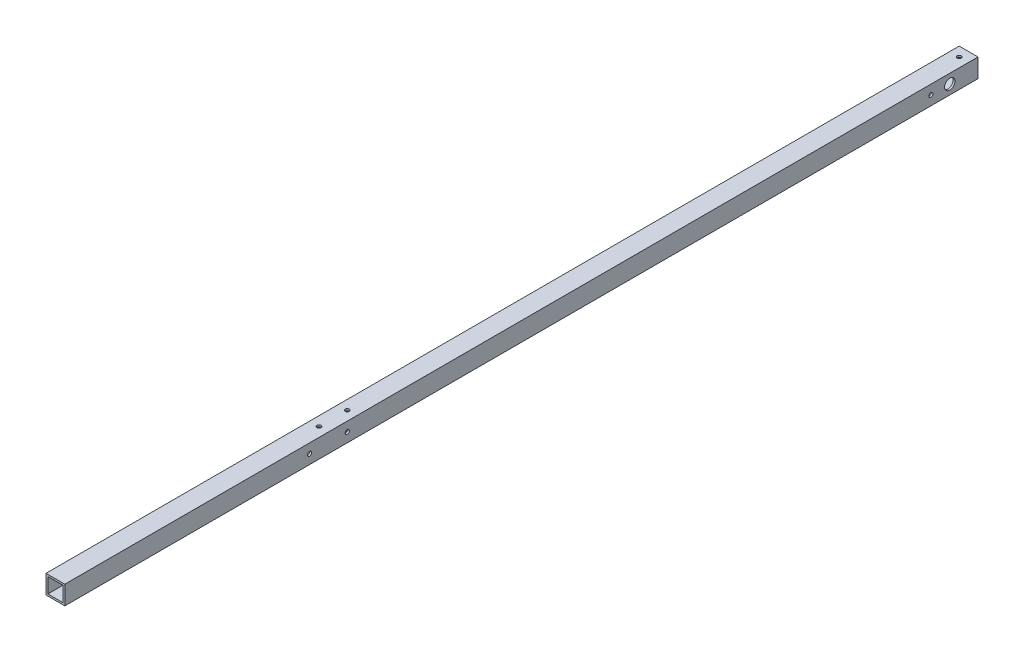
ISO-10303-21;
HEADER;
FILE_DESCRIPTION(('STEP AP214'),'2;1');
FILE_NAME('part.step','',(''),(''),'','','');
FILE_SCHEMA(('AUTOMOTIVE_DESIGN { 1 0 10303 214 1 1 1 1 }'));
ENDSEC;
DATA;
#1=APPLICATION_CONTEXT('core data for automotive mechanical design processes');
#2=APPLICATION_PROTOCOL_DEFINITION('international standard','automotive_design',2000,#1);
#3=PRODUCT_CONTEXT('',#1,'mechanical');
#4=PRODUCT('Part','Part','',(#3));
#5=PRODUCT_RELATED_PRODUCT_CATEGORY('part','',(#4));
#6=PRODUCT_DEFINITION_FORMATION('','',#4);
#7=PRODUCT_DEFINITION_CONTEXT('part definition',#1,'design');
#8=PRODUCT_DEFINITION('design','',#6,#7);
#9=PRODUCT_DEFINITION_SHAPE('','',#8);
#10=(LENGTH_UNIT() NAMED_UNIT(*) SI_UNIT(.MILLI.,.METRE.));
#11=(NAMED_UNIT(*) PLANE_ANGLE_UNIT() SI_UNIT($,.RADIAN.));
#12=(NAMED_UNIT(*) SI_UNIT($,.STERADIAN.) SOLID_ANGLE_UNIT());
#13=UNCERTAINTY_MEASURE_WITH_UNIT(LENGTH_MEASURE(1.E-05),#10,'distance_accuracy_value','');
#14=(GEOMETRIC_REPRESENTATION_CONTEXT(3) GLOBAL_UNCERTAINTY_ASSIGNED_CONTEXT((#13)) GLOBAL_UNIT_ASSIGNED_CONTEXT((#10,
#11,#12)) REPRESENTATION_CONTEXT('',''));
#15=CARTESIAN_POINT('',(0.,0.,0.));
#16=DIRECTION('',(0.,0.,1.));
#17=DIRECTION('',(1.,0.,0.));
#18=AXIS2_PLACEMENT_3D('',#15,#16,#17);
#19=CARTESIAN_POINT('',(0.,0.,970.));
#20=DIRECTION('',(0.,0.,1.));
#21=DIRECTION('',(1.,0.,0.));
#22=AXIS2_PLACEMENT_3D('',#19,#20,#21);
#23=PLANE('',#22);
#24=DIRECTION('',(0.,1.,0.));
#25=VECTOR('',#24,1.);
#26=CARTESIAN_POINT('',(10.,10.,970.));
#27=LINE('',#26,#25);
#28=CARTESIAN_POINT('',(10.,-10.,970.));
#29=VERTEX_POINT('',#28);
#30=CARTESIAN_POINT('',(10.,10.,970.));
#31=VERTEX_POINT('',#30);
#32=EDGE_CURVE('E157',#29,#31,#27,.T.);
#33=ORIENTED_EDGE('',*,*,#32,.T.);
#34=DIRECTION('',(-1.,0.,0.));
#35=VECTOR('',#34,1.);
#36=CARTESIAN_POINT('',(-10.,10.,970.));
#37=LINE('',#36,#35);
#38=CARTESIAN_POINT('',(-10.,10.,970.));
#39=VERTEX_POINT('',#38);
#40=EDGE_CURVE('E161',#31,#39,#37,.T.);
#41=ORIENTED_EDGE('',*,*,#40,.T.);
#42=DIRECTION('',(0.,-1.,0.));
#43=VECTOR('',#42,1.);
#44=CARTESIAN_POINT('',(-10.,10.,970.));
#45=LINE('',#44,#43);
#46=CARTESIAN_POINT('',(-10.,-10.,970.));
#47=VERTEX_POINT('',#46);
#48=EDGE_CURVE('E165',#39,#47,#45,.T.);
#49=ORIENTED_EDGE('',*,*,#48,.T.);
#50=DIRECTION('',(1.,0.,0.));
#51=VECTOR('',#50,1.);
#52=CARTESIAN_POINT('',(-10.,-10.,970.));
#53=LINE('',#52,#51);
#54=EDGE_CURVE('E168',#47,#29,#53,.T.);
#55=ORIENTED_EDGE('',*,*,#54,.T.);
#56=EDGE_LOOP('',(#33,#41,#49,#55));
#57=FACE_BOUND('',#56,.T.);
#58=DIRECTION('',(-1.,0.,0.));
#59=VECTOR('',#58,1.);
#60=CARTESIAN_POINT('',(-8.,8.,970.));
#61=LINE('',#60,#59);
#62=CARTESIAN_POINT('',(8.,8.,970.));
#63=VERTEX_POINT('',#62);
#64=CARTESIAN_POINT('',(-8.,8.,970.));
#65=VERTEX_POINT('',#64);
#66=EDGE_CURVE('E116',#63,#65,#61,.T.);
#67=ORIENTED_EDGE('',*,*,#66,.F.);
#68=DIRECTION('',(0.,1.,0.));
#69=VECTOR('',#68,1.);
#70=CARTESIAN_POINT('',(8.,8.,970.));
#71=LINE('',#70,#69);
#72=CARTESIAN_POINT('',(8.,-8.,970.));
#73=VERTEX_POINT('',#72);
#74=EDGE_CURVE('E107',#73,#63,#71,.T.);
#75=ORIENTED_EDGE('',*,*,#74,.F.);
#76=DIRECTION('',(1.,0.,0.));
#77=VECTOR('',#76,1.);
#78=CARTESIAN_POINT('',(-8.,-8.,970.));
#79=LINE('',#78,#77);
#80=CARTESIAN_POINT('',(-8.,-8.,970.));
#81=VERTEX_POINT('',#80);
#82=EDGE_CURVE('E133',#81,#73,#79,.T.);
#83=ORIENTED_EDGE('',*,*,#82,.F.);
#84=DIRECTION('',(0.,-1.,0.));
#85=VECTOR('',#84,1.);
#86=CARTESIAN_POINT('',(-8.,8.,970.));
#87=LINE('',#86,#85);
#88=EDGE_CURVE('E129',#65,#81,#87,.T.);
#89=ORIENTED_EDGE('',*,*,#88,.F.);
#90=EDGE_LOOP('',(#67,#75,#83,#89));
#91=FACE_BOUND('',#90,.T.);
#92=ADVANCED_FACE('F39',(#57,#91),#23,.T.);
#93=CARTESIAN_POINT('',(0.,0.,0.));
#94=DIRECTION('',(0.,0.,1.));
#95=DIRECTION('',(1.,0.,0.));
#96=AXIS2_PLACEMENT_3D('',#93,#94,#95);
#97=PLANE('',#96);
#98=DIRECTION('',(0.,1.,0.));
#99=VECTOR('',#98,1.);
#100=CARTESIAN_POINT('',(10.,10.,0.));
#101=LINE('',#100,#99);
#102=CARTESIAN_POINT('',(10.,-10.,0.));
#103=VERTEX_POINT('',#102);
#104=CARTESIAN_POINT('',(10.,10.,0.));
#105=VERTEX_POINT('',#104);
#106=EDGE_CURVE('E125',#103,#105,#101,.T.);
#107=ORIENTED_EDGE('',*,*,#106,.F.);
#108=DIRECTION('',(1.,0.,0.));
#109=VECTOR('',#108,1.);
#110=CARTESIAN_POINT('',(-10.,-10.,0.));
#111=LINE('',#110,#109);
#112=CARTESIAN_POINT('',(-10.,-10.,0.));
#113=VERTEX_POINT('',#112);
#114=EDGE_CURVE('E162',#113,#103,#111,.T.);
#115=ORIENTED_EDGE('',*,*,#114,.F.);
#116=DIRECTION('',(0.,-1.,0.));
#117=VECTOR('',#116,1.);
#118=CARTESIAN_POINT('',(-10.,10.,0.));
#119=LINE('',#118,#117);
#120=CARTESIAN_POINT('',(-10.,10.,0.));
#121=VERTEX_POINT('',#120);
#122=EDGE_CURVE('E178',#121,#113,#119,.T.);
#123=ORIENTED_EDGE('',*,*,#122,.F.);
#124=DIRECTION('',(-1.,0.,0.));
#125=VECTOR('',#124,1.);
#126=CARTESIAN_POINT('',(-10.,10.,0.));
#127=LINE('',#126,#125);
#128=EDGE_CURVE('E175',#105,#121,#127,.T.);
#129=ORIENTED_EDGE('',*,*,#128,.F.);
#130=EDGE_LOOP('',(#107,#115,#123,#129));
#131=FACE_BOUND('',#130,.T.);
#132=DIRECTION('',(0.,1.,0.));
#133=VECTOR('',#132,1.);
#134=CARTESIAN_POINT('',(8.,8.,0.));
#135=LINE('',#134,#133);
#136=CARTESIAN_POINT('',(8.,-8.,0.));
#137=VERTEX_POINT('',#136);
#138=CARTESIAN_POINT('',(8.,8.,0.));
#139=VERTEX_POINT('',#138);
#140=EDGE_CURVE('E65',#137,#139,#135,.T.);
#141=ORIENTED_EDGE('',*,*,#140,.T.);
#142=DIRECTION('',(-1.,0.,0.));
#143=VECTOR('',#142,1.);
#144=CARTESIAN_POINT('',(-8.,8.,0.));
#145=LINE('',#144,#143);
#146=CARTESIAN_POINT('',(-8.,8.,0.));
#147=VERTEX_POINT('',#146);
#148=EDGE_CURVE('E123',#139,#147,#145,.T.);
#149=ORIENTED_EDGE('',*,*,#148,.T.);
#150=DIRECTION('',(0.,-1.,0.));
#151=VECTOR('',#150,1.);
#152=CARTESIAN_POINT('',(-8.,8.,0.));
#153=LINE('',#152,#151);
#154=CARTESIAN_POINT('',(-8.,-8.,0.));
#155=VERTEX_POINT('',#154);
#156=EDGE_CURVE('E144',#147,#155,#153,.T.);
#157=ORIENTED_EDGE('',*,*,#156,.T.);
#158=DIRECTION('',(1.,0.,0.));
#159=VECTOR('',#158,1.);
#160=CARTESIAN_POINT('',(-8.,-8.,0.));
#161=LINE('',#160,#159);
#162=EDGE_CURVE('E117',#155,#137,#161,.T.);
#163=ORIENTED_EDGE('',*,*,#162,.T.);
#164=EDGE_LOOP('',(#141,#149,#157,#163));
#165=FACE_BOUND('',#164,.T.);
#166=ADVANCED_FACE('F320',(#131,#165),#97,.F.);
#167=CARTESIAN_POINT('',(10.,10.,970.));
#168=DIRECTION('',(-1.,0.,0.));
#169=DIRECTION('',(0.,0.,1.));
#170=AXIS2_PLACEMENT_3D('',#167,#168,#169);
#171=PLANE('',#170);
#172=CARTESIAN_POINT('',(10.,0.,710.));
#173=DIRECTION('',(1.,0.,0.));
#174=DIRECTION('',(0.,0.,-1.));
#175=AXIS2_PLACEMENT_3D('',#172,#173,#174);
#176=CIRCLE('',#175,2.19999999999998);
#177=CARTESIAN_POINT('',(10.,0.,707.8));
#178=VERTEX_POINT('',#177);
#179=EDGE_CURVE('E198',#178,#178,#176,.T.);
#180=ORIENTED_EDGE('',*,*,#179,.F.);
#181=EDGE_LOOP('',(#180));
#182=FACE_BOUND('',#181,.T.);
#183=CARTESIAN_POINT('',(10.,0.,49.9999999999999));
#184=DIRECTION('',(1.,0.,0.));
#185=DIRECTION('',(0.,0.,-1.));
#186=AXIS2_PLACEMENT_3D('',#183,#184,#185);
#187=CIRCLE('',#186,2.2);
#188=CARTESIAN_POINT('',(10.,0.,47.7999999999999));
#189=VERTEX_POINT('',#188);
#190=EDGE_CURVE('E254',#189,#189,#187,.T.);
#191=ORIENTED_EDGE('',*,*,#190,.F.);
#192=EDGE_LOOP('',(#191));
#193=FACE_BOUND('',#192,.T.);
#194=CARTESIAN_POINT('',(10.,0.,29.9999999999999));
#195=DIRECTION('',(1.,0.,0.));
#196=DIRECTION('',(0.,0.,-1.));
#197=AXIS2_PLACEMENT_3D('',#194,#195,#196);
#198=CIRCLE('',#197,5.5);
#199=CARTESIAN_POINT('',(10.,0.,24.4999999999999));
#200=VERTEX_POINT('',#199);
#201=EDGE_CURVE('E262',#200,#200,#198,.T.);
#202=ORIENTED_EDGE('',*,*,#201,.F.);
#203=EDGE_LOOP('',(#202));
#204=FACE_BOUND('',#203,.T.);
#205=CARTESIAN_POINT('',(10.,0.,670.));
#206=DIRECTION('',(1.,0.,0.));
#207=DIRECTION('',(0.,0.,-1.));
#208=AXIS2_PLACEMENT_3D('',#205,#206,#207);
#209=CIRCLE('',#208,2.19999999999998);
#210=CARTESIAN_POINT('',(10.,0.,667.8));
#211=VERTEX_POINT('',#210);
#212=EDGE_CURVE('E258',#211,#211,#209,.T.);
#213=ORIENTED_EDGE('',*,*,#212,.F.);
#214=EDGE_LOOP('',(#213));
#215=FACE_BOUND('',#214,.T.);
#216=ORIENTED_EDGE('',*,*,#106,.T.);
#217=DIRECTION('',(0.,0.,-1.));
#218=VECTOR('',#217,1.);
#219=CARTESIAN_POINT('',(10.,10.,970.));
#220=LINE('',#219,#218);
#221=EDGE_CURVE('E11',#31,#105,#220,.T.);
#222=ORIENTED_EDGE('',*,*,#221,.F.);
#223=ORIENTED_EDGE('',*,*,#32,.F.);
#224=DIRECTION('',(0.,0.,-1.));
#225=VECTOR('',#224,1.);
#226=CARTESIAN_POINT('',(10.,-10.,970.));
#227=LINE('',#226,#225);
#228=EDGE_CURVE('E171',#29,#103,#227,.T.);
#229=ORIENTED_EDGE('',*,*,#228,.T.);
#230=EDGE_LOOP('',(#216,#222,#223,#229));
#231=FACE_BOUND('',#230,.T.);
#232=ADVANCED_FACE('F41',(#182,#193,#204,#215,#231),#171,.F.);
#233=CARTESIAN_POINT('',(-10.,10.,970.));
#234=DIRECTION('',(0.,-1.,0.));
#235=DIRECTION('',(1.,0.,0.));
#236=AXIS2_PLACEMENT_3D('',#233,#234,#235);
#237=PLANE('',#236);
#238=CARTESIAN_POINT('',(0.,10.,9.9999999999999));
#239=DIRECTION('',(0.,1.,0.));
#240=DIRECTION('',(-1.,0.,0.));
#241=AXIS2_PLACEMENT_3D('',#238,#239,#240);
#242=CIRCLE('',#241,2.2);
#243=CARTESIAN_POINT('',(-2.2,10.,9.9999999999999));
#244=VERTEX_POINT('',#243);
#245=EDGE_CURVE('E221',#244,#244,#242,.T.);
#246=ORIENTED_EDGE('',*,*,#245,.F.);
#247=EDGE_LOOP('',(#246));
#248=FACE_BOUND('',#247,.T.);
#249=CARTESIAN_POINT('',(0.,10.,660.));
#250=DIRECTION('',(0.,1.,0.));
#251=DIRECTION('',(-1.,0.,0.));
#252=AXIS2_PLACEMENT_3D('',#249,#250,#251);
#253=CIRCLE('',#252,2.19999999999999);
#254=CARTESIAN_POINT('',(-2.19999999999999,10.,660.));
#255=VERTEX_POINT('',#254);
#256=EDGE_CURVE('E349',#255,#255,#253,.T.);
#257=ORIENTED_EDGE('',*,*,#256,.F.);
#258=EDGE_LOOP('',(#257));
#259=FACE_BOUND('',#258,.T.);
#260=CARTESIAN_POINT('',(0.,10.,690.));
#261=DIRECTION('',(0.,1.,0.));
#262=DIRECTION('',(-1.,0.,0.));
#263=AXIS2_PLACEMENT_3D('',#260,#261,#262);
#264=CIRCLE('',#263,2.19999999999999);
#265=CARTESIAN_POINT('',(-2.19999999999999,10.,690.));
#266=VERTEX_POINT('',#265);
#267=EDGE_CURVE('E353',#266,#266,#264,.T.);
#268=ORIENTED_EDGE('',*,*,#267,.F.);
#269=EDGE_LOOP('',(#268));
#270=FACE_BOUND('',#269,.T.);
#271=ORIENTED_EDGE('',*,*,#128,.T.);
#272=DIRECTION('',(0.,0.,-1.));
#273=VECTOR('',#272,1.);
#274=CARTESIAN_POINT('',(-10.,10.,970.));
#275=LINE('',#274,#273);
#276=EDGE_CURVE('E49',#39,#121,#275,.T.);
#277=ORIENTED_EDGE('',*,*,#276,.F.);
#278=ORIENTED_EDGE('',*,*,#40,.F.);
#279=ORIENTED_EDGE('',*,*,#221,.T.);
#280=EDGE_LOOP('',(#271,#277,#278,#279));
#281=FACE_BOUND('',#280,.T.);
#282=ADVANCED_FACE('F336',(#248,#259,#270,#281),#237,.F.);
#283=CARTESIAN_POINT('',(-10.,10.,970.));
#284=DIRECTION('',(1.,0.,0.));
#285=DIRECTION('',(0.,0.,-1.));
#286=AXIS2_PLACEMENT_3D('',#283,#284,#285);
#287=PLANE('',#286);
#288=CARTESIAN_POINT('',(-10.,0.,710.));
#289=DIRECTION('',(1.,0.,0.));
#290=DIRECTION('',(0.,0.,-1.));
#291=AXIS2_PLACEMENT_3D('',#288,#289,#290);
#292=CIRCLE('',#291,2.19999999999998);
#293=CARTESIAN_POINT('',(-10.,0.,707.8));
#294=VERTEX_POINT('',#293);
#295=EDGE_CURVE('E141',#294,#294,#292,.T.);
#296=ORIENTED_EDGE('',*,*,#295,.T.);
#297=EDGE_LOOP('',(#296));
#298=FACE_BOUND('',#297,.T.);
#299=CARTESIAN_POINT('',(-10.,0.,49.9999999999999));
#300=DIRECTION('',(1.,0.,0.));
#301=DIRECTION('',(0.,0.,-1.));
#302=AXIS2_PLACEMENT_3D('',#299,#300,#301);
#303=CIRCLE('',#302,2.2);
#304=CARTESIAN_POINT('',(-10.,0.,47.7999999999999));
#305=VERTEX_POINT('',#304);
#306=EDGE_CURVE('E216',#305,#305,#303,.T.);
#307=ORIENTED_EDGE('',*,*,#306,.T.);
#308=EDGE_LOOP('',(#307));
#309=FACE_BOUND('',#308,.T.);
#310=CARTESIAN_POINT('',(-10.,0.,29.9999999999999));
#311=DIRECTION('',(1.,0.,0.));
#312=DIRECTION('',(0.,0.,-1.));
#313=AXIS2_PLACEMENT_3D('',#310,#311,#312);
#314=CIRCLE('',#313,5.5);
#315=CARTESIAN_POINT('',(-10.,0.,24.4999999999999));
#316=VERTEX_POINT('',#315);
#317=EDGE_CURVE('E210',#316,#316,#314,.T.);
#318=ORIENTED_EDGE('',*,*,#317,.T.);
#319=EDGE_LOOP('',(#318));
#320=FACE_BOUND('',#319,.T.);
#321=CARTESIAN_POINT('',(-10.,0.,670.));
#322=DIRECTION('',(1.,0.,0.));
#323=DIRECTION('',(0.,0.,-1.));
#324=AXIS2_PLACEMENT_3D('',#321,#322,#323);
#325=CIRCLE('',#324,2.19999999999998);
#326=CARTESIAN_POINT('',(-10.,0.,667.8));
#327=VERTEX_POINT('',#326);
#328=EDGE_CURVE('E204',#327,#327,#325,.T.);
#329=ORIENTED_EDGE('',*,*,#328,.T.);
#330=EDGE_LOOP('',(#329));
#331=FACE_BOUND('',#330,.T.);
#332=ORIENTED_EDGE('',*,*,#122,.T.);
#333=DIRECTION('',(0.,0.,-1.));
#334=VECTOR('',#333,1.);
#335=CARTESIAN_POINT('',(-10.,-10.,970.));
#336=LINE('',#335,#334);
#337=EDGE_CURVE('E186',#47,#113,#336,.T.);
#338=ORIENTED_EDGE('',*,*,#337,.F.);
#339=ORIENTED_EDGE('',*,*,#48,.F.);
#340=ORIENTED_EDGE('',*,*,#276,.T.);
#341=EDGE_LOOP('',(#332,#338,#339,#340));
#342=FACE_BOUND('',#341,.T.);
#343=ADVANCED_FACE('F293',(#298,#309,#320,#331,#342),#287,.F.);
#344=CARTESIAN_POINT('',(-10.,-10.,970.));
#345=DIRECTION('',(0.,1.,0.));
#346=DIRECTION('',(0.,0.,1.));
#347=AXIS2_PLACEMENT_3D('',#344,#345,#346);
#348=PLANE('',#347);
#349=CARTESIAN_POINT('',(0.,-10.,9.9999999999999));
#350=DIRECTION('',(0.,1.,0.));
#351=DIRECTION('',(0.,0.,1.));
#352=AXIS2_PLACEMENT_3D('',#349,#350,#351);
#353=CIRCLE('',#352,2.2);
#354=CARTESIAN_POINT('',(0.,-10.,12.1999999999999));
#355=VERTEX_POINT('',#354);
#356=EDGE_CURVE('E250',#355,#355,#353,.T.);
#357=ORIENTED_EDGE('',*,*,#356,.T.);
#358=EDGE_LOOP('',(#357));
#359=FACE_BOUND('',#358,.T.);
#360=CARTESIAN_POINT('',(0.,-10.,660.));
#361=DIRECTION('',(0.,1.,0.));
#362=DIRECTION('',(0.,0.,1.));
#363=AXIS2_PLACEMENT_3D('',#360,#361,#362);
#364=CIRCLE('',#363,2.19999999999999);
#365=CARTESIAN_POINT('',(0.,-10.,662.2));
#366=VERTEX_POINT('',#365);
#367=EDGE_CURVE('E232',#366,#366,#364,.T.);
#368=ORIENTED_EDGE('',*,*,#367,.T.);
#369=EDGE_LOOP('',(#368));
#370=FACE_BOUND('',#369,.T.);
#371=CARTESIAN_POINT('',(0.,-10.,690.));
#372=DIRECTION('',(0.,1.,0.));
#373=DIRECTION('',(0.,0.,1.));
#374=AXIS2_PLACEMENT_3D('',#371,#372,#373);
#375=CIRCLE('',#374,2.19999999999999);
#376=CARTESIAN_POINT('',(0.,-10.,692.2));
#377=VERTEX_POINT('',#376);
#378=EDGE_CURVE('E226',#377,#377,#375,.T.);
#379=ORIENTED_EDGE('',*,*,#378,.T.);
#380=EDGE_LOOP('',(#379));
#381=FACE_BOUND('',#380,.T.);
#382=ORIENTED_EDGE('',*,*,#114,.T.);
#383=ORIENTED_EDGE('',*,*,#228,.F.);
#384=ORIENTED_EDGE('',*,*,#54,.F.);
#385=ORIENTED_EDGE('',*,*,#337,.T.);
#386=EDGE_LOOP('',(#382,#383,#384,#385));
#387=FACE_BOUND('',#386,.T.);
#388=ADVANCED_FACE('F331',(#359,#370,#381,#387),#348,.F.);
#389=CARTESIAN_POINT('',(8.,8.,970.));
#390=DIRECTION('',(-1.,0.,0.));
#391=DIRECTION('',(0.,-1.,0.));
#392=AXIS2_PLACEMENT_3D('',#389,#390,#391);
#393=PLANE('',#392);
#394=CARTESIAN_POINT('',(8.00000000000001,0.,710.));
#395=DIRECTION('',(-1.,0.,0.));
#396=DIRECTION('',(0.,-1.,0.));
#397=AXIS2_PLACEMENT_3D('',#394,#395,#396);
#398=CIRCLE('',#397,2.19999999999998);
#399=CARTESIAN_POINT('',(8.00000000000001,-2.19999999999998,710.));
#400=VERTEX_POINT('',#399);
#401=EDGE_CURVE('E215',#400,#400,#398,.T.);
#402=ORIENTED_EDGE('',*,*,#401,.F.);
#403=EDGE_LOOP('',(#402));
#404=FACE_BOUND('',#403,.T.);
#405=CARTESIAN_POINT('',(8.00000000000001,0.,49.9999999999999));
#406=DIRECTION('',(-1.,0.,0.));
#407=DIRECTION('',(0.,-1.,0.));
#408=AXIS2_PLACEMENT_3D('',#405,#406,#407);
#409=CIRCLE('',#408,2.2);
#410=CARTESIAN_POINT('',(8.00000000000001,-2.2,49.9999999999999));
#411=VERTEX_POINT('',#410);
#412=EDGE_CURVE('E209',#411,#411,#409,.T.);
#413=ORIENTED_EDGE('',*,*,#412,.F.);
#414=EDGE_LOOP('',(#413));
#415=FACE_BOUND('',#414,.T.);
#416=CARTESIAN_POINT('',(8.00000000000001,0.,29.9999999999999));
#417=DIRECTION('',(-1.,0.,0.));
#418=DIRECTION('',(0.,-1.,0.));
#419=AXIS2_PLACEMENT_3D('',#416,#417,#418);
#420=CIRCLE('',#419,5.5);
#421=CARTESIAN_POINT('',(8.00000000000001,-5.5,29.9999999999999));
#422=VERTEX_POINT('',#421);
#423=EDGE_CURVE('E203',#422,#422,#420,.T.);
#424=ORIENTED_EDGE('',*,*,#423,.F.);
#425=EDGE_LOOP('',(#424));
#426=FACE_BOUND('',#425,.T.);
#427=CARTESIAN_POINT('',(8.00000000000001,0.,670.));
#428=DIRECTION('',(-1.,0.,0.));
#429=DIRECTION('',(0.,-1.,0.));
#430=AXIS2_PLACEMENT_3D('',#427,#428,#429);
#431=CIRCLE('',#430,2.19999999999998);
#432=CARTESIAN_POINT('',(8.00000000000001,-2.19999999999998,670.));
#433=VERTEX_POINT('',#432);
#434=EDGE_CURVE('E197',#433,#433,#431,.T.);
#435=ORIENTED_EDGE('',*,*,#434,.F.);
#436=EDGE_LOOP('',(#435));
#437=FACE_BOUND('',#436,.T.);
#438=ORIENTED_EDGE('',*,*,#140,.F.);
#439=DIRECTION('',(0.,0.,-1.));
#440=VECTOR('',#439,1.);
#441=CARTESIAN_POINT('',(8.,-8.,970.));
#442=LINE('',#441,#440);
#443=EDGE_CURVE('E111',#73,#137,#442,.T.);
#444=ORIENTED_EDGE('',*,*,#443,.F.);
#445=ORIENTED_EDGE('',*,*,#74,.T.);
#446=DIRECTION('',(0.,0.,-1.));
#447=VECTOR('',#446,1.);
#448=CARTESIAN_POINT('',(8.,8.,970.));
#449=LINE('',#448,#447);
#450=EDGE_CURVE('E110',#63,#139,#449,.T.);
#451=ORIENTED_EDGE('',*,*,#450,.T.);
#452=EDGE_LOOP('',(#438,#444,#445,#451));
#453=FACE_BOUND('',#452,.T.);
#454=ADVANCED_FACE('F109',(#404,#415,#426,#437,#453),#393,.T.);
#455=CARTESIAN_POINT('',(-8.,8.,970.));
#456=DIRECTION('',(0.,-1.,0.));
#457=DIRECTION('',(0.,0.,-1.));
#458=AXIS2_PLACEMENT_3D('',#455,#456,#457);
#459=PLANE('',#458);
#460=CARTESIAN_POINT('',(0.,8.00000000000001,9.9999999999999));
#461=DIRECTION('',(0.,-1.,0.));
#462=DIRECTION('',(0.,0.,-1.));
#463=AXIS2_PLACEMENT_3D('',#460,#461,#462);
#464=CIRCLE('',#463,2.2);
#465=CARTESIAN_POINT('',(0.,8.00000000000001,7.7999999999999));
#466=VERTEX_POINT('',#465);
#467=EDGE_CURVE('E246',#466,#466,#464,.T.);
#468=ORIENTED_EDGE('',*,*,#467,.F.);
#469=EDGE_LOOP('',(#468));
#470=FACE_BOUND('',#469,.T.);
#471=CARTESIAN_POINT('',(0.,8.00000000000001,660.));
#472=DIRECTION('',(0.,-1.,0.));
#473=DIRECTION('',(0.,0.,-1.));
#474=AXIS2_PLACEMENT_3D('',#471,#472,#473);
#475=CIRCLE('',#474,2.19999999999999);
#476=CARTESIAN_POINT('',(0.,8.00000000000001,657.8));
#477=VERTEX_POINT('',#476);
#478=EDGE_CURVE('E225',#477,#477,#475,.T.);
#479=ORIENTED_EDGE('',*,*,#478,.F.);
#480=EDGE_LOOP('',(#479));
#481=FACE_BOUND('',#480,.T.);
#482=CARTESIAN_POINT('',(0.,8.00000000000001,690.));
#483=DIRECTION('',(0.,-1.,0.));
#484=DIRECTION('',(0.,0.,-1.));
#485=AXIS2_PLACEMENT_3D('',#482,#483,#484);
#486=CIRCLE('',#485,2.19999999999999);
#487=CARTESIAN_POINT('',(0.,8.00000000000001,687.8));
#488=VERTEX_POINT('',#487);
#489=EDGE_CURVE('E220',#488,#488,#486,.T.);
#490=ORIENTED_EDGE('',*,*,#489,.F.);
#491=EDGE_LOOP('',(#490));
#492=FACE_BOUND('',#491,.T.);
#493=ORIENTED_EDGE('',*,*,#148,.F.);
#494=ORIENTED_EDGE('',*,*,#450,.F.);
#495=ORIENTED_EDGE('',*,*,#66,.T.);
#496=DIRECTION('',(0.,0.,-1.));
#497=VECTOR('',#496,1.);
#498=CARTESIAN_POINT('',(-8.,8.,970.));
#499=LINE('',#498,#497);
#500=EDGE_CURVE('E126',#65,#147,#499,.T.);
#501=ORIENTED_EDGE('',*,*,#500,.T.);
#502=EDGE_LOOP('',(#493,#494,#495,#501));
#503=FACE_BOUND('',#502,.T.);
#504=ADVANCED_FACE('F120',(#470,#481,#492,#503),#459,.T.);
#505=CARTESIAN_POINT('',(-8.,8.,970.));
#506=DIRECTION('',(1.,0.,0.));
#507=DIRECTION('',(0.,0.,-1.));
#508=AXIS2_PLACEMENT_3D('',#505,#506,#507);
#509=PLANE('',#508);
#510=CARTESIAN_POINT('',(-8.00000000000001,0.,710.));
#511=DIRECTION('',(1.,0.,0.));
#512=DIRECTION('',(0.,0.,-1.));
#513=AXIS2_PLACEMENT_3D('',#510,#511,#512);
#514=CIRCLE('',#513,2.19999999999998);
#515=CARTESIAN_POINT('',(-8.00000000000001,0.,707.8));
#516=VERTEX_POINT('',#515);
#517=EDGE_CURVE('E211',#516,#516,#514,.T.);
#518=ORIENTED_EDGE('',*,*,#517,.F.);
#519=EDGE_LOOP('',(#518));
#520=FACE_BOUND('',#519,.T.);
#521=CARTESIAN_POINT('',(-8.00000000000001,0.,49.9999999999999));
#522=DIRECTION('',(1.,0.,0.));
#523=DIRECTION('',(0.,0.,-1.));
#524=AXIS2_PLACEMENT_3D('',#521,#522,#523);
#525=CIRCLE('',#524,2.2);
#526=CARTESIAN_POINT('',(-8.00000000000001,0.,47.7999999999999));
#527=VERTEX_POINT('',#526);
#528=EDGE_CURVE('E205',#527,#527,#525,.T.);
#529=ORIENTED_EDGE('',*,*,#528,.F.);
#530=EDGE_LOOP('',(#529));
#531=FACE_BOUND('',#530,.T.);
#532=CARTESIAN_POINT('',(-8.00000000000001,0.,29.9999999999999));
#533=DIRECTION('',(1.,0.,0.));
#534=DIRECTION('',(0.,0.,-1.));
#535=AXIS2_PLACEMENT_3D('',#532,#533,#534);
#536=CIRCLE('',#535,5.5);
#537=CARTESIAN_POINT('',(-8.00000000000001,0.,24.4999999999999));
#538=VERTEX_POINT('',#537);
#539=EDGE_CURVE('E199',#538,#538,#536,.T.);
#540=ORIENTED_EDGE('',*,*,#539,.F.);
#541=EDGE_LOOP('',(#540));
#542=FACE_BOUND('',#541,.T.);
#543=CARTESIAN_POINT('',(-8.00000000000001,0.,670.));
#544=DIRECTION('',(1.,0.,0.));
#545=DIRECTION('',(0.,0.,-1.));
#546=AXIS2_PLACEMENT_3D('',#543,#544,#545);
#547=CIRCLE('',#546,2.19999999999998);
#548=CARTESIAN_POINT('',(-8.00000000000001,0.,667.8));
#549=VERTEX_POINT('',#548);
#550=EDGE_CURVE('E193',#549,#549,#547,.T.);
#551=ORIENTED_EDGE('',*,*,#550,.F.);
#552=EDGE_LOOP('',(#551));
#553=FACE_BOUND('',#552,.T.);
#554=ORIENTED_EDGE('',*,*,#156,.F.);
#555=ORIENTED_EDGE('',*,*,#500,.F.);
#556=ORIENTED_EDGE('',*,*,#88,.T.);
#557=DIRECTION('',(0.,0.,-1.));
#558=VECTOR('',#557,1.);
#559=CARTESIAN_POINT('',(-8.,-8.,970.));
#560=LINE('',#559,#558);
#561=EDGE_CURVE('E57',#81,#155,#560,.T.);
#562=ORIENTED_EDGE('',*,*,#561,.T.);
#563=EDGE_LOOP('',(#554,#555,#556,#562));
#564=FACE_BOUND('',#563,.T.);
#565=ADVANCED_FACE('F371',(#520,#531,#542,#553,#564),#509,.T.);
#566=CARTESIAN_POINT('',(-8.,-8.,970.));
#567=DIRECTION('',(0.,1.,0.));
#568=DIRECTION('',(0.,0.,1.));
#569=AXIS2_PLACEMENT_3D('',#566,#567,#568);
#570=PLANE('',#569);
#571=CARTESIAN_POINT('',(0.,-8.00000000000001,9.9999999999999));
#572=DIRECTION('',(0.,1.,0.));
#573=DIRECTION('',(0.,0.,1.));
#574=AXIS2_PLACEMENT_3D('',#571,#572,#573);
#575=CIRCLE('',#574,2.2);
#576=CARTESIAN_POINT('',(0.,-8.00000000000001,12.1999999999999));
#577=VERTEX_POINT('',#576);
#578=EDGE_CURVE('E43',#577,#577,#575,.T.);
#579=ORIENTED_EDGE('',*,*,#578,.F.);
#580=EDGE_LOOP('',(#579));
#581=FACE_BOUND('',#580,.T.);
#582=CARTESIAN_POINT('',(0.,-8.00000000000001,660.));
#583=DIRECTION('',(0.,1.,0.));
#584=DIRECTION('',(0.,0.,1.));
#585=AXIS2_PLACEMENT_3D('',#582,#583,#584);
#586=CIRCLE('',#585,2.19999999999999);
#587=CARTESIAN_POINT('',(0.,-8.00000000000001,662.2));
#588=VERTEX_POINT('',#587);
#589=EDGE_CURVE('E222',#588,#588,#586,.T.);
#590=ORIENTED_EDGE('',*,*,#589,.F.);
#591=EDGE_LOOP('',(#590));
#592=FACE_BOUND('',#591,.T.);
#593=CARTESIAN_POINT('',(0.,-8.00000000000001,690.));
#594=DIRECTION('',(0.,1.,0.));
#595=DIRECTION('',(0.,0.,1.));
#596=AXIS2_PLACEMENT_3D('',#593,#594,#595);
#597=CIRCLE('',#596,2.19999999999999);
#598=CARTESIAN_POINT('',(0.,-8.00000000000001,692.2));
#599=VERTEX_POINT('',#598);
#600=EDGE_CURVE('E217',#599,#599,#597,.T.);
#601=ORIENTED_EDGE('',*,*,#600,.F.);
#602=EDGE_LOOP('',(#601));
#603=FACE_BOUND('',#602,.T.);
#604=ORIENTED_EDGE('',*,*,#162,.F.);
#605=ORIENTED_EDGE('',*,*,#561,.F.);
#606=ORIENTED_EDGE('',*,*,#82,.T.);
#607=ORIENTED_EDGE('',*,*,#443,.T.);
#608=EDGE_LOOP('',(#604,#605,#606,#607));
#609=FACE_BOUND('',#608,.T.);
#610=ADVANCED_FACE('F369',(#581,#592,#603,#609),#570,.T.);
#611=CARTESIAN_POINT('',(-960.,0.,670.));
#612=DIRECTION('',(1.,0.,0.));
#613=DIRECTION('',(0.,0.,-1.));
#614=AXIS2_PLACEMENT_3D('',#611,#612,#613);
#615=CYLINDRICAL_SURFACE('',#614,2.19999999999998);
#616=ORIENTED_EDGE('',*,*,#550,.T.);
#617=EDGE_LOOP('',(#616));
#618=FACE_BOUND('',#617,.T.);
#619=ORIENTED_EDGE('',*,*,#328,.F.);
#620=EDGE_LOOP('',(#619));
#621=FACE_BOUND('',#620,.T.);
#622=ADVANCED_FACE('F310',(#618,#621),#615,.F.);
#623=CARTESIAN_POINT('',(-960.,0.,29.9999999999999));
#624=DIRECTION('',(1.,0.,0.));
#625=DIRECTION('',(0.,0.,-1.));
#626=AXIS2_PLACEMENT_3D('',#623,#624,#625);
#627=CYLINDRICAL_SURFACE('',#626,5.5);
#628=ORIENTED_EDGE('',*,*,#539,.T.);
#629=EDGE_LOOP('',(#628));
#630=FACE_BOUND('',#629,.T.);
#631=ORIENTED_EDGE('',*,*,#317,.F.);
#632=EDGE_LOOP('',(#631));
#633=FACE_BOUND('',#632,.T.);
#634=ADVANCED_FACE('F311',(#630,#633),#627,.F.);
#635=CARTESIAN_POINT('',(-960.,0.,49.9999999999999));
#636=DIRECTION('',(1.,0.,0.));
#637=DIRECTION('',(0.,0.,-1.));
#638=AXIS2_PLACEMENT_3D('',#635,#636,#637);
#639=CYLINDRICAL_SURFACE('',#638,2.2);
#640=ORIENTED_EDGE('',*,*,#528,.T.);
#641=EDGE_LOOP('',(#640));
#642=FACE_BOUND('',#641,.T.);
#643=ORIENTED_EDGE('',*,*,#306,.F.);
#644=EDGE_LOOP('',(#643));
#645=FACE_BOUND('',#644,.T.);
#646=ADVANCED_FACE('F299',(#642,#645),#639,.F.);
#647=CARTESIAN_POINT('',(-960.,0.,710.));
#648=DIRECTION('',(1.,0.,0.));
#649=DIRECTION('',(0.,0.,-1.));
#650=AXIS2_PLACEMENT_3D('',#647,#648,#649);
#651=CYLINDRICAL_SURFACE('',#650,2.19999999999998);
#652=ORIENTED_EDGE('',*,*,#517,.T.);
#653=EDGE_LOOP('',(#652));
#654=FACE_BOUND('',#653,.T.);
#655=ORIENTED_EDGE('',*,*,#295,.F.);
#656=EDGE_LOOP('',(#655));
#657=FACE_BOUND('',#656,.T.);
#658=ADVANCED_FACE('F296',(#654,#657),#651,.F.);
#659=ORIENTED_EDGE('',*,*,#434,.T.);
#660=EDGE_LOOP('',(#659));
#661=FACE_BOUND('',#660,.T.);
#662=ORIENTED_EDGE('',*,*,#212,.T.);
#663=EDGE_LOOP('',(#662));
#664=FACE_BOUND('',#663,.T.);
#665=ADVANCED_FACE('F298',(#661,#664),#615,.F.);
#666=ORIENTED_EDGE('',*,*,#423,.T.);
#667=EDGE_LOOP('',(#666));
#668=FACE_BOUND('',#667,.T.);
#669=ORIENTED_EDGE('',*,*,#201,.T.);
#670=EDGE_LOOP('',(#669));
#671=FACE_BOUND('',#670,.T.);
#672=ADVANCED_FACE('F307',(#668,#671),#627,.F.);
#673=ORIENTED_EDGE('',*,*,#412,.T.);
#674=EDGE_LOOP('',(#673));
#675=FACE_BOUND('',#674,.T.);
#676=ORIENTED_EDGE('',*,*,#190,.T.);
#677=EDGE_LOOP('',(#676));
#678=FACE_BOUND('',#677,.T.);
#679=ADVANCED_FACE('F314',(#675,#678),#639,.F.);
#680=ORIENTED_EDGE('',*,*,#401,.T.);
#681=EDGE_LOOP('',(#680));
#682=FACE_BOUND('',#681,.T.);
#683=ORIENTED_EDGE('',*,*,#179,.T.);
#684=EDGE_LOOP('',(#683));
#685=FACE_BOUND('',#684,.T.);
#686=ADVANCED_FACE('F302',(#682,#685),#651,.F.);
#687=CARTESIAN_POINT('',(0.,-960.,690.));
#688=DIRECTION('',(0.,1.,0.));
#689=DIRECTION('',(-1.,0.,0.));
#690=AXIS2_PLACEMENT_3D('',#687,#688,#689);
#691=CYLINDRICAL_SURFACE('',#690,2.19999999999999);
#692=ORIENTED_EDGE('',*,*,#600,.T.);
#693=EDGE_LOOP('',(#692));
#694=FACE_BOUND('',#693,.T.);
#695=ORIENTED_EDGE('',*,*,#378,.F.);
#696=EDGE_LOOP('',(#695));
#697=FACE_BOUND('',#696,.T.);
#698=ADVANCED_FACE('F317',(#694,#697),#691,.F.);
#699=CARTESIAN_POINT('',(0.,-960.,660.));
#700=DIRECTION('',(0.,1.,0.));
#701=DIRECTION('',(-1.,0.,0.));
#702=AXIS2_PLACEMENT_3D('',#699,#700,#701);
#703=CYLINDRICAL_SURFACE('',#702,2.19999999999999);
#704=ORIENTED_EDGE('',*,*,#589,.T.);
#705=EDGE_LOOP('',(#704));
#706=FACE_BOUND('',#705,.T.);
#707=ORIENTED_EDGE('',*,*,#367,.F.);
#708=EDGE_LOOP('',(#707));
#709=FACE_BOUND('',#708,.T.);
#710=ADVANCED_FACE('F416',(#706,#709),#703,.F.);
#711=CARTESIAN_POINT('',(0.,-960.,9.9999999999999));
#712=DIRECTION('',(0.,1.,0.));
#713=DIRECTION('',(-1.,0.,0.));
#714=AXIS2_PLACEMENT_3D('',#711,#712,#713);
#715=CYLINDRICAL_SURFACE('',#714,2.2);
#716=ORIENTED_EDGE('',*,*,#578,.T.);
#717=EDGE_LOOP('',(#716));
#718=FACE_BOUND('',#717,.T.);
#719=ORIENTED_EDGE('',*,*,#356,.F.);
#720=EDGE_LOOP('',(#719));
#721=FACE_BOUND('',#720,.T.);
#722=ADVANCED_FACE('F400',(#718,#721),#715,.F.);
#723=ORIENTED_EDGE('',*,*,#489,.T.);
#724=EDGE_LOOP('',(#723));
#725=FACE_BOUND('',#724,.T.);
#726=ORIENTED_EDGE('',*,*,#267,.T.);
#727=EDGE_LOOP('',(#726));
#728=FACE_BOUND('',#727,.T.);
#729=ADVANCED_FACE('F396',(#725,#728),#691,.F.);
#730=ORIENTED_EDGE('',*,*,#478,.T.);
#731=EDGE_LOOP('',(#730));
#732=FACE_BOUND('',#731,.T.);
#733=ORIENTED_EDGE('',*,*,#256,.T.);
#734=EDGE_LOOP('',(#733));
#735=FACE_BOUND('',#734,.T.);
#736=ADVANCED_FACE('F399',(#732,#735),#703,.F.);
#737=ORIENTED_EDGE('',*,*,#467,.T.);
#738=EDGE_LOOP('',(#737));
#739=FACE_BOUND('',#738,.T.);
#740=ORIENTED_EDGE('',*,*,#245,.T.);
#741=EDGE_LOOP('',(#740));
#742=FACE_BOUND('',#741,.T.);
#743=ADVANCED_FACE('F407',(#739,#742),#715,.F.);
#744=CLOSED_SHELL('',(#92,#166,#232,#282,#343,#388,#454,#504,#565,#610,#622,#634,#646,#658,#665,
#672,#679,#686,#698,#710,#722,#729,#736,#743));
#745=MANIFOLD_SOLID_BREP('B2',#744);
#746=ADVANCED_BREP_SHAPE_REPRESENTATION('',(#18,#745),#14);
#747=SHAPE_DEFINITION_REPRESENTATION(#9,#746);
ENDSEC;
END-ISO-10303-21;
